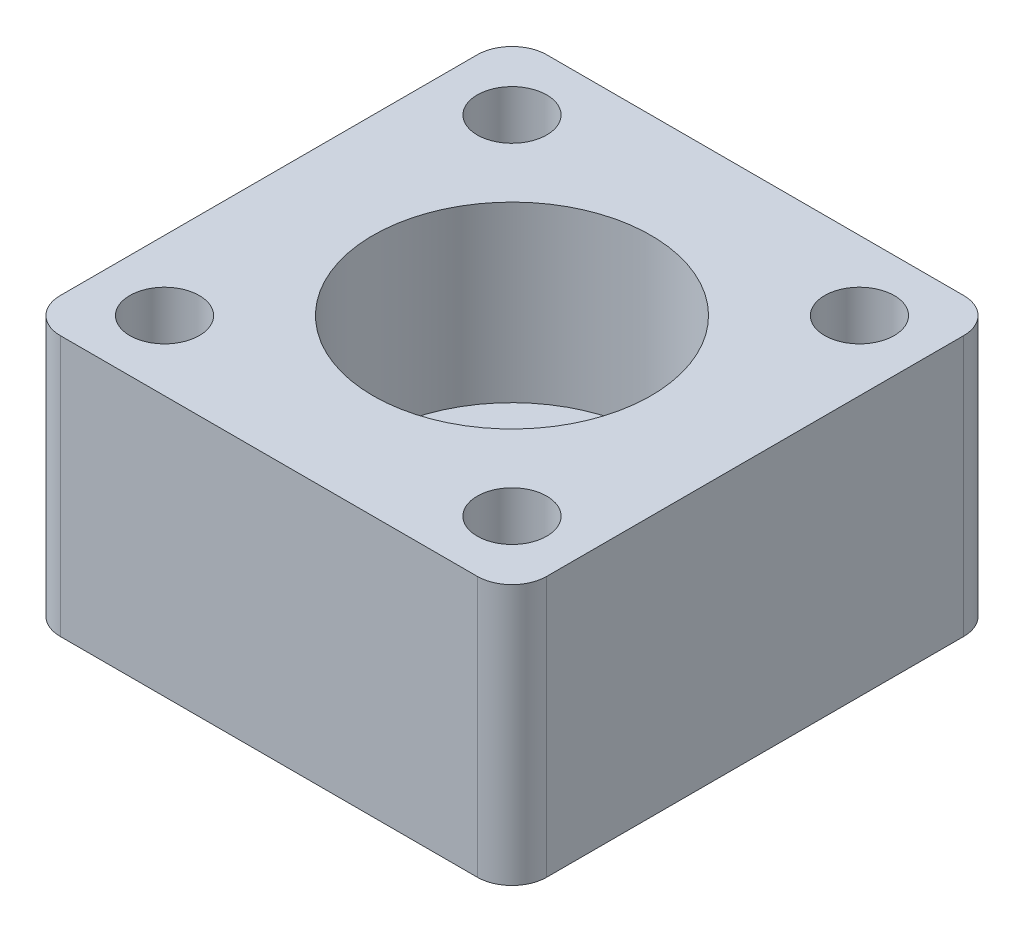
ISO-10303-21;
HEADER;
FILE_DESCRIPTION(('STEP AP214'),'2;1');
FILE_NAME('part.step','',(''),(''),'','','');
FILE_SCHEMA(('AUTOMOTIVE_DESIGN { 1 0 10303 214 1 1 1 1 }'));
ENDSEC;
DATA;
#1=APPLICATION_CONTEXT('core data for automotive mechanical design processes');
#2=APPLICATION_PROTOCOL_DEFINITION('international standard','automotive_design',2000,#1);
#3=PRODUCT_CONTEXT('',#1,'mechanical');
#4=PRODUCT('Part','Part','',(#3));
#5=PRODUCT_RELATED_PRODUCT_CATEGORY('part','',(#4));
#6=PRODUCT_DEFINITION_FORMATION('','',#4);
#7=PRODUCT_DEFINITION_CONTEXT('part definition',#1,'design');
#8=PRODUCT_DEFINITION('design','',#6,#7);
#9=PRODUCT_DEFINITION_SHAPE('','',#8);
#10=(LENGTH_UNIT() NAMED_UNIT(*) SI_UNIT(.MILLI.,.METRE.));
#11=(NAMED_UNIT(*) PLANE_ANGLE_UNIT() SI_UNIT($,.RADIAN.));
#12=(NAMED_UNIT(*) SI_UNIT($,.STERADIAN.) SOLID_ANGLE_UNIT());
#13=UNCERTAINTY_MEASURE_WITH_UNIT(LENGTH_MEASURE(1.E-05),#10,'distance_accuracy_value','');
#14=(GEOMETRIC_REPRESENTATION_CONTEXT(3) GLOBAL_UNCERTAINTY_ASSIGNED_CONTEXT((#13)) GLOBAL_UNIT_ASSIGNED_CONTEXT((#10,
#11,#12)) REPRESENTATION_CONTEXT('',''));
#15=CARTESIAN_POINT('',(0.,0.,0.));
#16=DIRECTION('',(0.,0.,1.));
#17=DIRECTION('',(1.,0.,0.));
#18=AXIS2_PLACEMENT_3D('',#15,#16,#17);
#19=CARTESIAN_POINT('',(14.,0.,-14.));
#20=DIRECTION('',(0.,1.,0.));
#21=DIRECTION('',(0.,0.,1.));
#22=AXIS2_PLACEMENT_3D('',#19,#20,#21);
#23=CYLINDRICAL_SURFACE('',#22,5.);
#24=CARTESIAN_POINT('',(14.,0.,-14.));
#25=DIRECTION('',(0.,1.,0.));
#26=DIRECTION('',(0.,0.,1.));
#27=AXIS2_PLACEMENT_3D('',#24,#25,#26);
#28=CIRCLE('',#27,5.);
#29=CARTESIAN_POINT('',(14.,0.,-9.));
#30=VERTEX_POINT('',#29);
#31=EDGE_CURVE('E126',#30,#30,#28,.T.);
#32=ORIENTED_EDGE('',*,*,#31,.F.);
#33=EDGE_LOOP('',(#32));
#34=FACE_BOUND('',#33,.T.);
#35=CARTESIAN_POINT('',(14.,5.,-14.));
#36=DIRECTION('',(0.,1.,0.));
#37=DIRECTION('',(0.,0.,1.));
#38=AXIS2_PLACEMENT_3D('',#35,#36,#37);
#39=CIRCLE('',#38,5.);
#40=CARTESIAN_POINT('',(14.,5.,-9.));
#41=VERTEX_POINT('',#40);
#42=EDGE_CURVE('E141',#41,#41,#39,.F.);
#43=ORIENTED_EDGE('',*,*,#42,.F.);
#44=EDGE_LOOP('',(#43));
#45=FACE_BOUND('',#44,.T.);
#46=ADVANCED_FACE('F33',(#34,#45),#23,.F.);
#47=CARTESIAN_POINT('',(0.,15.,0.));
#48=DIRECTION('',(0.,0.,-1.));
#49=DIRECTION('',(-1.,0.,0.));
#50=AXIS2_PLACEMENT_3D('',#47,#48,#49);
#51=PLANE('',#50);
#52=DIRECTION('',(1.,0.,0.));
#53=VECTOR('',#52,1.);
#54=CARTESIAN_POINT('',(0.,15.,0.));
#55=LINE('',#54,#53);
#56=CARTESIAN_POINT('',(2.,15.,0.));
#57=VERTEX_POINT('',#56);
#58=CARTESIAN_POINT('',(26.,15.,0.));
#59=VERTEX_POINT('',#58);
#60=EDGE_CURVE('E119',#57,#59,#55,.T.);
#61=ORIENTED_EDGE('',*,*,#60,.F.);
#62=DIRECTION('',(0.,-1.,0.));
#63=VECTOR('',#62,1.);
#64=CARTESIAN_POINT('',(2.,15.,0.));
#65=LINE('',#64,#63);
#66=CARTESIAN_POINT('',(2.,0.,0.));
#67=VERTEX_POINT('',#66);
#68=EDGE_CURVE('E103',#57,#67,#65,.T.);
#69=ORIENTED_EDGE('',*,*,#68,.T.);
#70=DIRECTION('',(1.,0.,0.));
#71=VECTOR('',#70,1.);
#72=CARTESIAN_POINT('',(0.,0.,0.));
#73=LINE('',#72,#71);
#74=CARTESIAN_POINT('',(26.,0.,0.));
#75=VERTEX_POINT('',#74);
#76=EDGE_CURVE('E116',#67,#75,#73,.T.);
#77=ORIENTED_EDGE('',*,*,#76,.T.);
#78=DIRECTION('',(0.,-1.,0.));
#79=VECTOR('',#78,1.);
#80=CARTESIAN_POINT('',(26.,15.,0.));
#81=LINE('',#80,#79);
#82=EDGE_CURVE('E121',#75,#59,#81,.F.);
#83=ORIENTED_EDGE('',*,*,#82,.T.);
#84=EDGE_LOOP('',(#61,#69,#77,#83));
#85=FACE_BOUND('',#84,.T.);
#86=ADVANCED_FACE('F115',(#85),#51,.F.);
#87=CARTESIAN_POINT('',(28.,15.,0.));
#88=DIRECTION('',(-1.,0.,0.));
#89=DIRECTION('',(0.,0.,1.));
#90=AXIS2_PLACEMENT_3D('',#87,#88,#89);
#91=PLANE('',#90);
#92=DIRECTION('',(0.,0.,-1.));
#93=VECTOR('',#92,1.);
#94=CARTESIAN_POINT('',(28.,15.,0.));
#95=LINE('',#94,#93);
#96=CARTESIAN_POINT('',(28.,15.,-2.));
#97=VERTEX_POINT('',#96);
#98=CARTESIAN_POINT('',(28.,15.,-26.));
#99=VERTEX_POINT('',#98);
#100=EDGE_CURVE('E170',#97,#99,#95,.T.);
#101=ORIENTED_EDGE('',*,*,#100,.F.);
#102=DIRECTION('',(0.,-1.,0.));
#103=VECTOR('',#102,1.);
#104=CARTESIAN_POINT('',(28.,15.,-2.));
#105=LINE('',#104,#103);
#106=CARTESIAN_POINT('',(28.,0.,-2.));
#107=VERTEX_POINT('',#106);
#108=EDGE_CURVE('E163',#97,#107,#105,.T.);
#109=ORIENTED_EDGE('',*,*,#108,.T.);
#110=DIRECTION('',(0.,0.,-1.));
#111=VECTOR('',#110,1.);
#112=CARTESIAN_POINT('',(28.,0.,0.));
#113=LINE('',#112,#111);
#114=CARTESIAN_POINT('',(28.,0.,-26.));
#115=VERTEX_POINT('',#114);
#116=EDGE_CURVE('E125',#107,#115,#113,.T.);
#117=ORIENTED_EDGE('',*,*,#116,.T.);
#118=DIRECTION('',(0.,-1.,0.));
#119=VECTOR('',#118,1.);
#120=CARTESIAN_POINT('',(28.,15.,-26.));
#121=LINE('',#120,#119);
#122=EDGE_CURVE('E161',#115,#99,#121,.F.);
#123=ORIENTED_EDGE('',*,*,#122,.T.);
#124=EDGE_LOOP('',(#101,#109,#117,#123));
#125=FACE_BOUND('',#124,.T.);
#126=ADVANCED_FACE('F168',(#125),#91,.F.);
#127=CARTESIAN_POINT('',(0.,15.,-28.));
#128=DIRECTION('',(0.,0.,1.));
#129=DIRECTION('',(1.,0.,0.));
#130=AXIS2_PLACEMENT_3D('',#127,#128,#129);
#131=PLANE('',#130);
#132=DIRECTION('',(-1.,0.,0.));
#133=VECTOR('',#132,1.);
#134=CARTESIAN_POINT('',(0.,15.,-28.));
#135=LINE('',#134,#133);
#136=CARTESIAN_POINT('',(26.,15.,-28.));
#137=VERTEX_POINT('',#136);
#138=CARTESIAN_POINT('',(2.,15.,-28.));
#139=VERTEX_POINT('',#138);
#140=EDGE_CURVE('E178',#137,#139,#135,.T.);
#141=ORIENTED_EDGE('',*,*,#140,.F.);
#142=DIRECTION('',(0.,-1.,0.));
#143=VECTOR('',#142,1.);
#144=CARTESIAN_POINT('',(26.,15.,-28.));
#145=LINE('',#144,#143);
#146=CARTESIAN_POINT('',(26.,0.,-28.));
#147=VERTEX_POINT('',#146);
#148=EDGE_CURVE('E11',#137,#147,#145,.T.);
#149=ORIENTED_EDGE('',*,*,#148,.T.);
#150=DIRECTION('',(-1.,0.,0.));
#151=VECTOR('',#150,1.);
#152=CARTESIAN_POINT('',(0.,0.,-28.));
#153=LINE('',#152,#151);
#154=CARTESIAN_POINT('',(2.,0.,-28.));
#155=VERTEX_POINT('',#154);
#156=EDGE_CURVE('E129',#147,#155,#153,.T.);
#157=ORIENTED_EDGE('',*,*,#156,.T.);
#158=DIRECTION('',(0.,-1.,0.));
#159=VECTOR('',#158,1.);
#160=CARTESIAN_POINT('',(2.,15.,-28.));
#161=LINE('',#160,#159);
#162=EDGE_CURVE('E41',#155,#139,#161,.F.);
#163=ORIENTED_EDGE('',*,*,#162,.T.);
#164=EDGE_LOOP('',(#141,#149,#157,#163));
#165=FACE_BOUND('',#164,.T.);
#166=ADVANCED_FACE('F177',(#165),#131,.F.);
#167=CARTESIAN_POINT('',(0.,15.,0.));
#168=DIRECTION('',(1.,0.,0.));
#169=DIRECTION('',(0.,0.,-1.));
#170=AXIS2_PLACEMENT_3D('',#167,#168,#169);
#171=PLANE('',#170);
#172=DIRECTION('',(0.,0.,1.));
#173=VECTOR('',#172,1.);
#174=CARTESIAN_POINT('',(0.,0.,0.));
#175=LINE('',#174,#173);
#176=CARTESIAN_POINT('',(0.,0.,-26.));
#177=VERTEX_POINT('',#176);
#178=CARTESIAN_POINT('',(0.,0.,-2.));
#179=VERTEX_POINT('',#178);
#180=EDGE_CURVE('E139',#177,#179,#175,.T.);
#181=ORIENTED_EDGE('',*,*,#180,.T.);
#182=DIRECTION('',(0.,-1.,0.));
#183=VECTOR('',#182,1.);
#184=CARTESIAN_POINT('',(0.,15.,-2.));
#185=LINE('',#184,#183);
#186=CARTESIAN_POINT('',(0.,15.,-2.));
#187=VERTEX_POINT('',#186);
#188=EDGE_CURVE('E104',#179,#187,#185,.F.);
#189=ORIENTED_EDGE('',*,*,#188,.T.);
#190=DIRECTION('',(0.,0.,1.));
#191=VECTOR('',#190,1.);
#192=CARTESIAN_POINT('',(0.,15.,0.));
#193=LINE('',#192,#191);
#194=CARTESIAN_POINT('',(0.,15.,-26.));
#195=VERTEX_POINT('',#194);
#196=EDGE_CURVE('E135',#195,#187,#193,.T.);
#197=ORIENTED_EDGE('',*,*,#196,.F.);
#198=DIRECTION('',(0.,-1.,0.));
#199=VECTOR('',#198,1.);
#200=CARTESIAN_POINT('',(0.,15.,-26.));
#201=LINE('',#200,#199);
#202=EDGE_CURVE('E109',#195,#177,#201,.T.);
#203=ORIENTED_EDGE('',*,*,#202,.T.);
#204=EDGE_LOOP('',(#181,#189,#197,#203));
#205=FACE_BOUND('',#204,.T.);
#206=ADVANCED_FACE('F224',(#205),#171,.F.);
#207=CARTESIAN_POINT('',(28.,15.,0.));
#208=DIRECTION('',(0.,1.,0.));
#209=DIRECTION('',(0.,0.,1.));
#210=AXIS2_PLACEMENT_3D('',#207,#208,#209);
#211=PLANE('',#210);
#212=CARTESIAN_POINT('',(14.,15.,-14.));
#213=DIRECTION('',(0.,1.,0.));
#214=DIRECTION('',(0.,0.,1.));
#215=AXIS2_PLACEMENT_3D('',#212,#213,#214);
#216=CIRCLE('',#215,8.);
#217=CARTESIAN_POINT('',(14.,15.,-6.));
#218=VERTEX_POINT('',#217);
#219=EDGE_CURVE('E206',#218,#218,#216,.T.);
#220=ORIENTED_EDGE('',*,*,#219,.F.);
#221=EDGE_LOOP('',(#220));
#222=FACE_BOUND('',#221,.T.);
#223=CARTESIAN_POINT('',(24.,15.,-4.));
#224=DIRECTION('',(0.,1.,0.));
#225=DIRECTION('',(0.,0.,1.));
#226=AXIS2_PLACEMENT_3D('',#223,#224,#225);
#227=CIRCLE('',#226,2.);
#228=CARTESIAN_POINT('',(24.,15.,-2.));
#229=VERTEX_POINT('',#228);
#230=EDGE_CURVE('E144',#229,#229,#227,.T.);
#231=ORIENTED_EDGE('',*,*,#230,.F.);
#232=EDGE_LOOP('',(#231));
#233=FACE_BOUND('',#232,.T.);
#234=CARTESIAN_POINT('',(4.,15.,-4.));
#235=DIRECTION('',(0.,1.,0.));
#236=DIRECTION('',(0.,0.,1.));
#237=AXIS2_PLACEMENT_3D('',#234,#235,#236);
#238=CIRCLE('',#237,2.);
#239=CARTESIAN_POINT('',(4.,15.,-2.));
#240=VERTEX_POINT('',#239);
#241=EDGE_CURVE('E196',#240,#240,#238,.T.);
#242=ORIENTED_EDGE('',*,*,#241,.F.);
#243=EDGE_LOOP('',(#242));
#244=FACE_BOUND('',#243,.T.);
#245=CARTESIAN_POINT('',(24.,15.,-24.));
#246=DIRECTION('',(0.,1.,0.));
#247=DIRECTION('',(0.,0.,1.));
#248=AXIS2_PLACEMENT_3D('',#245,#246,#247);
#249=CIRCLE('',#248,2.);
#250=CARTESIAN_POINT('',(24.,15.,-22.));
#251=VERTEX_POINT('',#250);
#252=EDGE_CURVE('E190',#251,#251,#249,.T.);
#253=ORIENTED_EDGE('',*,*,#252,.F.);
#254=EDGE_LOOP('',(#253));
#255=FACE_BOUND('',#254,.T.);
#256=CARTESIAN_POINT('',(4.,15.,-24.));
#257=DIRECTION('',(0.,1.,0.));
#258=DIRECTION('',(0.,0.,1.));
#259=AXIS2_PLACEMENT_3D('',#256,#257,#258);
#260=CIRCLE('',#259,2.);
#261=CARTESIAN_POINT('',(4.,15.,-22.));
#262=VERTEX_POINT('',#261);
#263=EDGE_CURVE('E184',#262,#262,#260,.T.);
#264=ORIENTED_EDGE('',*,*,#263,.F.);
#265=EDGE_LOOP('',(#264));
#266=FACE_BOUND('',#265,.T.);
#267=ORIENTED_EDGE('',*,*,#196,.T.);
#268=CARTESIAN_POINT('',(2.,15.,-2.));
#269=DIRECTION('',(0.,1.,0.));
#270=DIRECTION('',(0.,0.,1.));
#271=AXIS2_PLACEMENT_3D('',#268,#269,#270);
#272=CIRCLE('',#271,2.);
#273=EDGE_CURVE('E159',#187,#57,#272,.T.);
#274=ORIENTED_EDGE('',*,*,#273,.T.);
#275=ORIENTED_EDGE('',*,*,#60,.T.);
#276=CARTESIAN_POINT('',(26.,15.,-2.));
#277=DIRECTION('',(0.,1.,0.));
#278=DIRECTION('',(0.,0.,1.));
#279=AXIS2_PLACEMENT_3D('',#276,#277,#278);
#280=CIRCLE('',#279,2.);
#281=EDGE_CURVE('E157',#59,#97,#280,.T.);
#282=ORIENTED_EDGE('',*,*,#281,.T.);
#283=ORIENTED_EDGE('',*,*,#100,.T.);
#284=CARTESIAN_POINT('',(26.,15.,-26.));
#285=DIRECTION('',(0.,1.,0.));
#286=DIRECTION('',(0.,0.,1.));
#287=AXIS2_PLACEMENT_3D('',#284,#285,#286);
#288=CIRCLE('',#287,2.);
#289=EDGE_CURVE('E54',#99,#137,#288,.T.);
#290=ORIENTED_EDGE('',*,*,#289,.T.);
#291=ORIENTED_EDGE('',*,*,#140,.T.);
#292=CARTESIAN_POINT('',(2.,15.,-26.));
#293=DIRECTION('',(0.,1.,0.));
#294=DIRECTION('',(0.,0.,1.));
#295=AXIS2_PLACEMENT_3D('',#292,#293,#294);
#296=CIRCLE('',#295,2.);
#297=EDGE_CURVE('E154',#139,#195,#296,.T.);
#298=ORIENTED_EDGE('',*,*,#297,.T.);
#299=EDGE_LOOP('',(#267,#274,#275,#282,#283,#290,#291,#298));
#300=FACE_BOUND('',#299,.T.);
#301=ADVANCED_FACE('F221',(#222,#233,#244,#255,#266,#300),#211,.T.);
#302=CARTESIAN_POINT('',(28.,0.,0.));
#303=DIRECTION('',(0.,1.,0.));
#304=DIRECTION('',(0.,0.,1.));
#305=AXIS2_PLACEMENT_3D('',#302,#303,#304);
#306=PLANE('',#305);
#307=CARTESIAN_POINT('',(24.,0.,-4.));
#308=DIRECTION('',(0.,1.,0.));
#309=DIRECTION('',(0.,0.,1.));
#310=AXIS2_PLACEMENT_3D('',#307,#308,#309);
#311=CIRCLE('',#310,2.);
#312=CARTESIAN_POINT('',(24.,0.,-2.));
#313=VERTEX_POINT('',#312);
#314=EDGE_CURVE('E199',#313,#313,#311,.T.);
#315=ORIENTED_EDGE('',*,*,#314,.T.);
#316=EDGE_LOOP('',(#315));
#317=FACE_BOUND('',#316,.T.);
#318=CARTESIAN_POINT('',(4.,0.,-4.));
#319=DIRECTION('',(0.,1.,0.));
#320=DIRECTION('',(0.,0.,1.));
#321=AXIS2_PLACEMENT_3D('',#318,#319,#320);
#322=CIRCLE('',#321,2.);
#323=CARTESIAN_POINT('',(4.,0.,-2.));
#324=VERTEX_POINT('',#323);
#325=EDGE_CURVE('E193',#324,#324,#322,.T.);
#326=ORIENTED_EDGE('',*,*,#325,.T.);
#327=EDGE_LOOP('',(#326));
#328=FACE_BOUND('',#327,.T.);
#329=CARTESIAN_POINT('',(24.,0.,-24.));
#330=DIRECTION('',(0.,1.,0.));
#331=DIRECTION('',(0.,0.,1.));
#332=AXIS2_PLACEMENT_3D('',#329,#330,#331);
#333=CIRCLE('',#332,2.);
#334=CARTESIAN_POINT('',(24.,0.,-22.));
#335=VERTEX_POINT('',#334);
#336=EDGE_CURVE('E187',#335,#335,#333,.T.);
#337=ORIENTED_EDGE('',*,*,#336,.T.);
#338=EDGE_LOOP('',(#337));
#339=FACE_BOUND('',#338,.T.);
#340=CARTESIAN_POINT('',(4.,0.,-24.));
#341=DIRECTION('',(0.,1.,0.));
#342=DIRECTION('',(0.,0.,1.));
#343=AXIS2_PLACEMENT_3D('',#340,#341,#342);
#344=CIRCLE('',#343,2.);
#345=CARTESIAN_POINT('',(4.,0.,-22.));
#346=VERTEX_POINT('',#345);
#347=EDGE_CURVE('E132',#346,#346,#344,.T.);
#348=ORIENTED_EDGE('',*,*,#347,.T.);
#349=EDGE_LOOP('',(#348));
#350=FACE_BOUND('',#349,.T.);
#351=ORIENTED_EDGE('',*,*,#31,.T.);
#352=EDGE_LOOP('',(#351));
#353=FACE_BOUND('',#352,.T.);
#354=ORIENTED_EDGE('',*,*,#76,.F.);
#355=CARTESIAN_POINT('',(2.,0.,-2.));
#356=DIRECTION('',(0.,1.,0.));
#357=DIRECTION('',(0.,0.,1.));
#358=AXIS2_PLACEMENT_3D('',#355,#356,#357);
#359=CIRCLE('',#358,2.);
#360=EDGE_CURVE('E99',#67,#179,#359,.F.);
#361=ORIENTED_EDGE('',*,*,#360,.T.);
#362=ORIENTED_EDGE('',*,*,#180,.F.);
#363=CARTESIAN_POINT('',(2.,0.,-26.));
#364=DIRECTION('',(0.,1.,0.));
#365=DIRECTION('',(0.,0.,1.));
#366=AXIS2_PLACEMENT_3D('',#363,#364,#365);
#367=CIRCLE('',#366,2.);
#368=EDGE_CURVE('E120',#177,#155,#367,.F.);
#369=ORIENTED_EDGE('',*,*,#368,.T.);
#370=ORIENTED_EDGE('',*,*,#156,.F.);
#371=CARTESIAN_POINT('',(26.,0.,-26.));
#372=DIRECTION('',(0.,1.,0.));
#373=DIRECTION('',(0.,0.,1.));
#374=AXIS2_PLACEMENT_3D('',#371,#372,#373);
#375=CIRCLE('',#374,2.);
#376=EDGE_CURVE('E148',#147,#115,#375,.F.);
#377=ORIENTED_EDGE('',*,*,#376,.T.);
#378=ORIENTED_EDGE('',*,*,#116,.F.);
#379=CARTESIAN_POINT('',(26.,0.,-2.));
#380=DIRECTION('',(0.,1.,0.));
#381=DIRECTION('',(0.,0.,1.));
#382=AXIS2_PLACEMENT_3D('',#379,#380,#381);
#383=CIRCLE('',#382,2.);
#384=EDGE_CURVE('E110',#107,#75,#383,.F.);
#385=ORIENTED_EDGE('',*,*,#384,.T.);
#386=EDGE_LOOP('',(#354,#361,#362,#369,#370,#377,#378,#385));
#387=FACE_BOUND('',#386,.T.);
#388=ADVANCED_FACE('F123',(#317,#328,#339,#350,#353,#387),#306,.F.);
#389=CARTESIAN_POINT('',(4.,0.,-24.));
#390=DIRECTION('',(0.,1.,0.));
#391=DIRECTION('',(0.,0.,1.));
#392=AXIS2_PLACEMENT_3D('',#389,#390,#391);
#393=CYLINDRICAL_SURFACE('',#392,2.);
#394=ORIENTED_EDGE('',*,*,#347,.F.);
#395=EDGE_LOOP('',(#394));
#396=FACE_BOUND('',#395,.T.);
#397=ORIENTED_EDGE('',*,*,#263,.T.);
#398=EDGE_LOOP('',(#397));
#399=FACE_BOUND('',#398,.T.);
#400=ADVANCED_FACE('F252',(#396,#399),#393,.F.);
#401=CARTESIAN_POINT('',(24.,0.,-24.));
#402=DIRECTION('',(0.,1.,0.));
#403=DIRECTION('',(0.,0.,1.));
#404=AXIS2_PLACEMENT_3D('',#401,#402,#403);
#405=CYLINDRICAL_SURFACE('',#404,2.);
#406=ORIENTED_EDGE('',*,*,#336,.F.);
#407=EDGE_LOOP('',(#406));
#408=FACE_BOUND('',#407,.T.);
#409=ORIENTED_EDGE('',*,*,#252,.T.);
#410=EDGE_LOOP('',(#409));
#411=FACE_BOUND('',#410,.T.);
#412=ADVANCED_FACE('F323',(#408,#411),#405,.F.);
#413=CARTESIAN_POINT('',(4.,0.,-4.));
#414=DIRECTION('',(0.,1.,0.));
#415=DIRECTION('',(0.,0.,1.));
#416=AXIS2_PLACEMENT_3D('',#413,#414,#415);
#417=CYLINDRICAL_SURFACE('',#416,2.);
#418=ORIENTED_EDGE('',*,*,#325,.F.);
#419=EDGE_LOOP('',(#418));
#420=FACE_BOUND('',#419,.T.);
#421=ORIENTED_EDGE('',*,*,#241,.T.);
#422=EDGE_LOOP('',(#421));
#423=FACE_BOUND('',#422,.T.);
#424=ADVANCED_FACE('F314',(#420,#423),#417,.F.);
#425=CARTESIAN_POINT('',(24.,0.,-4.));
#426=DIRECTION('',(0.,1.,0.));
#427=DIRECTION('',(0.,0.,1.));
#428=AXIS2_PLACEMENT_3D('',#425,#426,#427);
#429=CYLINDRICAL_SURFACE('',#428,2.);
#430=ORIENTED_EDGE('',*,*,#314,.F.);
#431=EDGE_LOOP('',(#430));
#432=FACE_BOUND('',#431,.T.);
#433=ORIENTED_EDGE('',*,*,#230,.T.);
#434=EDGE_LOOP('',(#433));
#435=FACE_BOUND('',#434,.T.);
#436=ADVANCED_FACE('F302',(#432,#435),#429,.F.);
#437=CARTESIAN_POINT('',(14.,5.,-14.));
#438=DIRECTION('',(0.,1.,0.));
#439=DIRECTION('',(0.,0.,1.));
#440=AXIS2_PLACEMENT_3D('',#437,#438,#439);
#441=PLANE('',#440);
#442=CARTESIAN_POINT('',(14.,5.,-14.));
#443=DIRECTION('',(0.,1.,0.));
#444=DIRECTION('',(0.,0.,1.));
#445=AXIS2_PLACEMENT_3D('',#442,#443,#444);
#446=CIRCLE('',#445,8.);
#447=CARTESIAN_POINT('',(14.,5.,-6.));
#448=VERTEX_POINT('',#447);
#449=EDGE_CURVE('E145',#448,#448,#446,.T.);
#450=ORIENTED_EDGE('',*,*,#449,.T.);
#451=EDGE_LOOP('',(#450));
#452=FACE_BOUND('',#451,.T.);
#453=ORIENTED_EDGE('',*,*,#42,.T.);
#454=EDGE_LOOP('',(#453));
#455=FACE_BOUND('',#454,.T.);
#456=ADVANCED_FACE('F212',(#452,#455),#441,.T.);
#457=CARTESIAN_POINT('',(14.,5.,-14.));
#458=DIRECTION('',(0.,1.,0.));
#459=DIRECTION('',(0.,0.,1.));
#460=AXIS2_PLACEMENT_3D('',#457,#458,#459);
#461=CYLINDRICAL_SURFACE('',#460,8.);
#462=ORIENTED_EDGE('',*,*,#449,.F.);
#463=EDGE_LOOP('',(#462));
#464=FACE_BOUND('',#463,.T.);
#465=ORIENTED_EDGE('',*,*,#219,.T.);
#466=EDGE_LOOP('',(#465));
#467=FACE_BOUND('',#466,.T.);
#468=ADVANCED_FACE('F215',(#464,#467),#461,.F.);
#469=CARTESIAN_POINT('',(2.,15.,-2.));
#470=DIRECTION('',(0.,-1.,0.));
#471=DIRECTION('',(0.,0.,-1.));
#472=AXIS2_PLACEMENT_3D('',#469,#470,#471);
#473=CYLINDRICAL_SURFACE('',#472,2.);
#474=ORIENTED_EDGE('',*,*,#273,.F.);
#475=ORIENTED_EDGE('',*,*,#188,.F.);
#476=ORIENTED_EDGE('',*,*,#360,.F.);
#477=ORIENTED_EDGE('',*,*,#68,.F.);
#478=EDGE_LOOP('',(#474,#475,#476,#477));
#479=FACE_BOUND('',#478,.T.);
#480=ADVANCED_FACE('F102',(#479),#473,.T.);
#481=CARTESIAN_POINT('',(26.,15.,-2.));
#482=DIRECTION('',(0.,-1.,0.));
#483=DIRECTION('',(0.,0.,-1.));
#484=AXIS2_PLACEMENT_3D('',#481,#482,#483);
#485=CYLINDRICAL_SURFACE('',#484,2.);
#486=ORIENTED_EDGE('',*,*,#281,.F.);
#487=ORIENTED_EDGE('',*,*,#82,.F.);
#488=ORIENTED_EDGE('',*,*,#384,.F.);
#489=ORIENTED_EDGE('',*,*,#108,.F.);
#490=EDGE_LOOP('',(#486,#487,#488,#489));
#491=FACE_BOUND('',#490,.T.);
#492=ADVANCED_FACE('F241',(#491),#485,.T.);
#493=CARTESIAN_POINT('',(26.,15.,-26.));
#494=DIRECTION('',(0.,-1.,0.));
#495=DIRECTION('',(0.,0.,-1.));
#496=AXIS2_PLACEMENT_3D('',#493,#494,#495);
#497=CYLINDRICAL_SURFACE('',#496,2.);
#498=ORIENTED_EDGE('',*,*,#289,.F.);
#499=ORIENTED_EDGE('',*,*,#122,.F.);
#500=ORIENTED_EDGE('',*,*,#376,.F.);
#501=ORIENTED_EDGE('',*,*,#148,.F.);
#502=EDGE_LOOP('',(#498,#499,#500,#501));
#503=FACE_BOUND('',#502,.T.);
#504=ADVANCED_FACE('F176',(#503),#497,.T.);
#505=CARTESIAN_POINT('',(2.,15.,-26.));
#506=DIRECTION('',(0.,-1.,0.));
#507=DIRECTION('',(0.,0.,-1.));
#508=AXIS2_PLACEMENT_3D('',#505,#506,#507);
#509=CYLINDRICAL_SURFACE('',#508,2.);
#510=ORIENTED_EDGE('',*,*,#297,.F.);
#511=ORIENTED_EDGE('',*,*,#162,.F.);
#512=ORIENTED_EDGE('',*,*,#368,.F.);
#513=ORIENTED_EDGE('',*,*,#202,.F.);
#514=EDGE_LOOP('',(#510,#511,#512,#513));
#515=FACE_BOUND('',#514,.T.);
#516=ADVANCED_FACE('F35',(#515),#509,.T.);
#517=CLOSED_SHELL('',(#46,#86,#126,#166,#206,#301,#388,#400,#412,#424,#436,#456,#468,#480,#492,
#504,#516));
#518=MANIFOLD_SOLID_BREP('B2',#517);
#519=ADVANCED_BREP_SHAPE_REPRESENTATION('',(#18,#518),#14);
#520=SHAPE_DEFINITION_REPRESENTATION(#9,#519);
ENDSEC;
END-ISO-10303-21;
